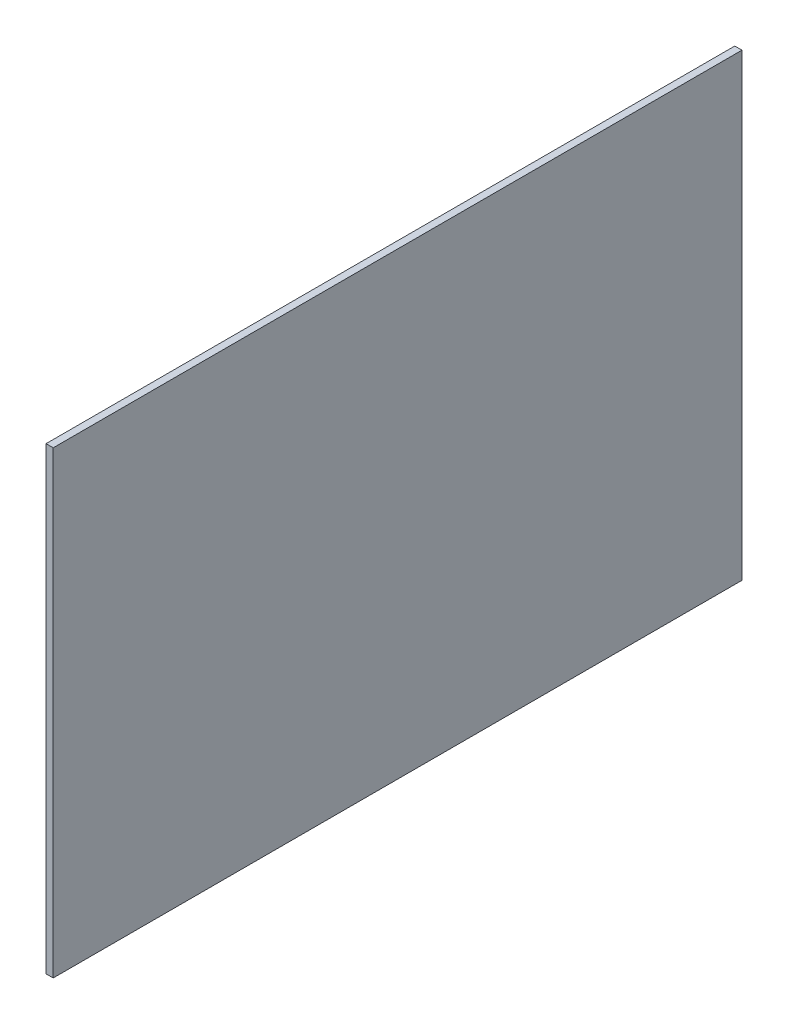
ISO-10303-21;
HEADER;
FILE_DESCRIPTION(('STEP AP214'),'2;1');
FILE_NAME('part.step','',(''),(''),'','','');
FILE_SCHEMA(('AUTOMOTIVE_DESIGN { 1 0 10303 214 1 1 1 1 }'));
ENDSEC;
DATA;
#1=APPLICATION_CONTEXT('core data for automotive mechanical design processes');
#2=APPLICATION_PROTOCOL_DEFINITION('international standard','automotive_design',2000,#1);
#3=PRODUCT_CONTEXT('',#1,'mechanical');
#4=PRODUCT('Part','Part','',(#3));
#5=PRODUCT_RELATED_PRODUCT_CATEGORY('part','',(#4));
#6=PRODUCT_DEFINITION_FORMATION('','',#4);
#7=PRODUCT_DEFINITION_CONTEXT('part definition',#1,'design');
#8=PRODUCT_DEFINITION('design','',#6,#7);
#9=PRODUCT_DEFINITION_SHAPE('','',#8);
#10=(LENGTH_UNIT() NAMED_UNIT(*) SI_UNIT(.MILLI.,.METRE.));
#11=(NAMED_UNIT(*) PLANE_ANGLE_UNIT() SI_UNIT($,.RADIAN.));
#12=(NAMED_UNIT(*) SI_UNIT($,.STERADIAN.) SOLID_ANGLE_UNIT());
#13=UNCERTAINTY_MEASURE_WITH_UNIT(LENGTH_MEASURE(1.E-05),#10,'distance_accuracy_value','');
#14=(GEOMETRIC_REPRESENTATION_CONTEXT(3) GLOBAL_UNCERTAINTY_ASSIGNED_CONTEXT((#13)) GLOBAL_UNIT_ASSIGNED_CONTEXT((#10,
#11,#12)) REPRESENTATION_CONTEXT('',''));
#15=CARTESIAN_POINT('',(0.,0.,0.));
#16=DIRECTION('',(0.,0.,1.));
#17=DIRECTION('',(1.,0.,0.));
#18=AXIS2_PLACEMENT_3D('',#15,#16,#17);
#19=CARTESIAN_POINT('',(0.79375,0.,0.));
#20=DIRECTION('',(0.,0.,-1.));
#21=DIRECTION('',(-1.,0.,0.));
#22=AXIS2_PLACEMENT_3D('',#19,#20,#21);
#23=PLANE('',#22);
#24=DIRECTION('',(0.,-1.,0.));
#25=VECTOR('',#24,1.);
#26=CARTESIAN_POINT('',(0.,0.,0.));
#27=LINE('',#26,#25);
#28=CARTESIAN_POINT('',(0.,50.8,0.));
#29=VERTEX_POINT('',#28);
#30=CARTESIAN_POINT('',(0.,0.,0.));
#31=VERTEX_POINT('',#30);
#32=EDGE_CURVE('E95',#29,#31,#27,.T.);
#33=ORIENTED_EDGE('',*,*,#32,.T.);
#34=DIRECTION('',(-1.,0.,0.));
#35=VECTOR('',#34,1.);
#36=CARTESIAN_POINT('',(0.79375,0.,0.));
#37=LINE('',#36,#35);
#38=CARTESIAN_POINT('',(0.79375,0.,0.));
#39=VERTEX_POINT('',#38);
#40=EDGE_CURVE('E11',#39,#31,#37,.T.);
#41=ORIENTED_EDGE('',*,*,#40,.F.);
#42=DIRECTION('',(0.,-1.,0.));
#43=VECTOR('',#42,1.);
#44=CARTESIAN_POINT('',(0.79375,0.,0.));
#45=LINE('',#44,#43);
#46=CARTESIAN_POINT('',(0.79375,50.8,0.));
#47=VERTEX_POINT('',#46);
#48=EDGE_CURVE('E83',#47,#39,#45,.T.);
#49=ORIENTED_EDGE('',*,*,#48,.F.);
#50=DIRECTION('',(-1.,0.,0.));
#51=VECTOR('',#50,1.);
#52=CARTESIAN_POINT('',(0.79375,50.8,0.));
#53=LINE('',#52,#51);
#54=EDGE_CURVE('E91',#47,#29,#53,.T.);
#55=ORIENTED_EDGE('',*,*,#54,.T.);
#56=EDGE_LOOP('',(#33,#41,#49,#55));
#57=FACE_BOUND('',#56,.T.);
#58=ADVANCED_FACE('F32',(#57),#23,.F.);
#59=CARTESIAN_POINT('',(0.79375,0.,0.));
#60=DIRECTION('',(0.,1.,0.));
#61=DIRECTION('',(0.,0.,1.));
#62=AXIS2_PLACEMENT_3D('',#59,#60,#61);
#63=PLANE('',#62);
#64=DIRECTION('',(0.,0.,-1.));
#65=VECTOR('',#64,1.);
#66=CARTESIAN_POINT('',(0.,0.,0.));
#67=LINE('',#66,#65);
#68=CARTESIAN_POINT('',(0.,0.,-76.2));
#69=VERTEX_POINT('',#68);
#70=EDGE_CURVE('E87',#31,#69,#67,.T.);
#71=ORIENTED_EDGE('',*,*,#70,.T.);
#72=DIRECTION('',(-1.,0.,0.));
#73=VECTOR('',#72,1.);
#74=CARTESIAN_POINT('',(0.79375,0.,-76.2));
#75=LINE('',#74,#73);
#76=CARTESIAN_POINT('',(0.79375,0.,-76.2));
#77=VERTEX_POINT('',#76);
#78=EDGE_CURVE('E40',#77,#69,#75,.T.);
#79=ORIENTED_EDGE('',*,*,#78,.F.);
#80=DIRECTION('',(0.,0.,-1.));
#81=VECTOR('',#80,1.);
#82=CARTESIAN_POINT('',(0.79375,0.,0.));
#83=LINE('',#82,#81);
#84=EDGE_CURVE('E78',#39,#77,#83,.T.);
#85=ORIENTED_EDGE('',*,*,#84,.F.);
#86=ORIENTED_EDGE('',*,*,#40,.T.);
#87=EDGE_LOOP('',(#71,#79,#85,#86));
#88=FACE_BOUND('',#87,.T.);
#89=ADVANCED_FACE('F86',(#88),#63,.F.);
#90=CARTESIAN_POINT('',(0.79375,0.,-76.2));
#91=DIRECTION('',(0.,0.,1.));
#92=DIRECTION('',(1.,0.,0.));
#93=AXIS2_PLACEMENT_3D('',#90,#91,#92);
#94=PLANE('',#93);
#95=DIRECTION('',(0.,1.,0.));
#96=VECTOR('',#95,1.);
#97=CARTESIAN_POINT('',(0.,0.,-76.2));
#98=LINE('',#97,#96);
#99=CARTESIAN_POINT('',(0.,50.8,-76.2));
#100=VERTEX_POINT('',#99);
#101=EDGE_CURVE('E65',#69,#100,#98,.T.);
#102=ORIENTED_EDGE('',*,*,#101,.T.);
#103=DIRECTION('',(-1.,0.,0.));
#104=VECTOR('',#103,1.);
#105=CARTESIAN_POINT('',(0.79375,50.8,-76.2));
#106=LINE('',#105,#104);
#107=CARTESIAN_POINT('',(0.79375,50.8,-76.2));
#108=VERTEX_POINT('',#107);
#109=EDGE_CURVE('E88',#108,#100,#106,.T.);
#110=ORIENTED_EDGE('',*,*,#109,.F.);
#111=DIRECTION('',(0.,1.,0.));
#112=VECTOR('',#111,1.);
#113=CARTESIAN_POINT('',(0.79375,0.,-76.2));
#114=LINE('',#113,#112);
#115=EDGE_CURVE('E81',#77,#108,#114,.T.);
#116=ORIENTED_EDGE('',*,*,#115,.F.);
#117=ORIENTED_EDGE('',*,*,#78,.T.);
#118=EDGE_LOOP('',(#102,#110,#116,#117));
#119=FACE_BOUND('',#118,.T.);
#120=ADVANCED_FACE('F89',(#119),#94,.F.);
#121=CARTESIAN_POINT('',(0.79375,50.8,0.));
#122=DIRECTION('',(0.,-1.,0.));
#123=DIRECTION('',(0.,0.,-1.));
#124=AXIS2_PLACEMENT_3D('',#121,#122,#123);
#125=PLANE('',#124);
#126=DIRECTION('',(0.,0.,1.));
#127=VECTOR('',#126,1.);
#128=CARTESIAN_POINT('',(0.,50.8,0.));
#129=LINE('',#128,#127);
#130=EDGE_CURVE('E71',#100,#29,#129,.T.);
#131=ORIENTED_EDGE('',*,*,#130,.T.);
#132=ORIENTED_EDGE('',*,*,#54,.F.);
#133=DIRECTION('',(0.,0.,1.));
#134=VECTOR('',#133,1.);
#135=CARTESIAN_POINT('',(0.79375,50.8,0.));
#136=LINE('',#135,#134);
#137=EDGE_CURVE('E48',#108,#47,#136,.T.);
#138=ORIENTED_EDGE('',*,*,#137,.F.);
#139=ORIENTED_EDGE('',*,*,#109,.T.);
#140=EDGE_LOOP('',(#131,#132,#138,#139));
#141=FACE_BOUND('',#140,.T.);
#142=ADVANCED_FACE('F102',(#141),#125,.F.);
#143=CARTESIAN_POINT('',(0.79375,0.,0.));
#144=DIRECTION('',(-1.,0.,0.));
#145=DIRECTION('',(0.,0.,1.));
#146=AXIS2_PLACEMENT_3D('',#143,#144,#145);
#147=PLANE('',#146);
#148=ORIENTED_EDGE('',*,*,#48,.T.);
#149=ORIENTED_EDGE('',*,*,#84,.T.);
#150=ORIENTED_EDGE('',*,*,#115,.T.);
#151=ORIENTED_EDGE('',*,*,#137,.T.);
#152=EDGE_LOOP('',(#148,#149,#150,#151));
#153=FACE_BOUND('',#152,.T.);
#154=ADVANCED_FACE('F79',(#153),#147,.F.);
#155=CARTESIAN_POINT('',(0.,0.,0.));
#156=DIRECTION('',(-1.,0.,0.));
#157=DIRECTION('',(0.,0.,1.));
#158=AXIS2_PLACEMENT_3D('',#155,#156,#157);
#159=PLANE('',#158);
#160=ORIENTED_EDGE('',*,*,#32,.F.);
#161=ORIENTED_EDGE('',*,*,#130,.F.);
#162=ORIENTED_EDGE('',*,*,#101,.F.);
#163=ORIENTED_EDGE('',*,*,#70,.F.);
#164=EDGE_LOOP('',(#160,#161,#162,#163));
#165=FACE_BOUND('',#164,.T.);
#166=ADVANCED_FACE('F105',(#165),#159,.T.);
#167=CLOSED_SHELL('',(#58,#89,#120,#142,#154,#166));
#168=MANIFOLD_SOLID_BREP('B2',#167);
#169=ADVANCED_BREP_SHAPE_REPRESENTATION('',(#18,#168),#14);
#170=SHAPE_DEFINITION_REPRESENTATION(#9,#169);
ENDSEC;
END-ISO-10303-21;
